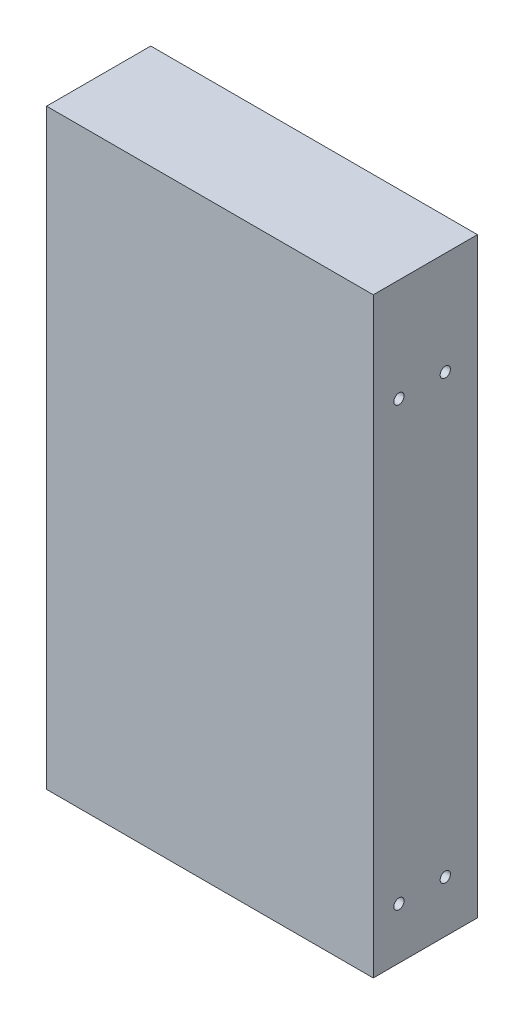
ISO-10303-21;
HEADER;
FILE_DESCRIPTION(('STEP AP214'),'2;1');
FILE_NAME('part.step','',(''),(''),'','','');
FILE_SCHEMA(('AUTOMOTIVE_DESIGN { 1 0 10303 214 1 1 1 1 }'));
ENDSEC;
DATA;
#1=APPLICATION_CONTEXT('core data for automotive mechanical design processes');
#2=APPLICATION_PROTOCOL_DEFINITION('international standard','automotive_design',2000,#1);
#3=PRODUCT_CONTEXT('',#1,'mechanical');
#4=PRODUCT('Part','Part','',(#3));
#5=PRODUCT_RELATED_PRODUCT_CATEGORY('part','',(#4));
#6=PRODUCT_DEFINITION_FORMATION('','',#4);
#7=PRODUCT_DEFINITION_CONTEXT('part definition',#1,'design');
#8=PRODUCT_DEFINITION('design','',#6,#7);
#9=PRODUCT_DEFINITION_SHAPE('','',#8);
#10=(LENGTH_UNIT() NAMED_UNIT(*) SI_UNIT(.MILLI.,.METRE.));
#11=(NAMED_UNIT(*) PLANE_ANGLE_UNIT() SI_UNIT($,.RADIAN.));
#12=(NAMED_UNIT(*) SI_UNIT($,.STERADIAN.) SOLID_ANGLE_UNIT());
#13=UNCERTAINTY_MEASURE_WITH_UNIT(LENGTH_MEASURE(1.E-05),#10,'distance_accuracy_value','');
#14=(GEOMETRIC_REPRESENTATION_CONTEXT(3) GLOBAL_UNCERTAINTY_ASSIGNED_CONTEXT((#13)) GLOBAL_UNIT_ASSIGNED_CONTEXT((#10,
#11,#12)) REPRESENTATION_CONTEXT('',''));
#15=CARTESIAN_POINT('',(0.,0.,0.));
#16=DIRECTION('',(0.,0.,1.));
#17=DIRECTION('',(1.,0.,0.));
#18=AXIS2_PLACEMENT_3D('',#15,#16,#17);
#19=CARTESIAN_POINT('',(0.,0.,40.5));
#20=DIRECTION('',(-1.,0.,0.));
#21=DIRECTION('',(0.,0.,1.));
#22=AXIS2_PLACEMENT_3D('',#19,#20,#21);
#23=PLANE('',#22);
#24=CARTESIAN_POINT('',(0.,20.,12.5));
#25=DIRECTION('',(1.,0.,0.));
#26=DIRECTION('',(0.,0.,-1.));
#27=AXIS2_PLACEMENT_3D('',#24,#25,#26);
#28=CIRCLE('',#27,2.00000000000001);
#29=CARTESIAN_POINT('',(0.,20.,10.5));
#30=VERTEX_POINT('',#29);
#31=EDGE_CURVE('E144',#30,#30,#28,.T.);
#32=ORIENTED_EDGE('',*,*,#31,.F.);
#33=EDGE_LOOP('',(#32));
#34=FACE_BOUND('',#33,.T.);
#35=CARTESIAN_POINT('',(0.,190.,30.5));
#36=DIRECTION('',(1.,0.,0.));
#37=DIRECTION('',(0.,0.,1.));
#38=AXIS2_PLACEMENT_3D('',#35,#36,#37);
#39=CIRCLE('',#38,2.);
#40=CARTESIAN_POINT('',(0.,190.,32.5));
#41=VERTEX_POINT('',#40);
#42=EDGE_CURVE('E135',#41,#41,#39,.T.);
#43=ORIENTED_EDGE('',*,*,#42,.F.);
#44=EDGE_LOOP('',(#43));
#45=FACE_BOUND('',#44,.T.);
#46=CARTESIAN_POINT('',(0.,20.,30.5));
#47=DIRECTION('',(1.,0.,0.));
#48=DIRECTION('',(0.,0.,1.));
#49=AXIS2_PLACEMENT_3D('',#46,#47,#48);
#50=CIRCLE('',#49,2.00000000000001);
#51=CARTESIAN_POINT('',(0.,20.,32.5));
#52=VERTEX_POINT('',#51);
#53=EDGE_CURVE('E151',#52,#52,#50,.T.);
#54=ORIENTED_EDGE('',*,*,#53,.F.);
#55=EDGE_LOOP('',(#54));
#56=FACE_BOUND('',#55,.T.);
#57=CARTESIAN_POINT('',(0.,190.,12.5));
#58=DIRECTION('',(1.,0.,0.));
#59=DIRECTION('',(0.,0.,-1.));
#60=AXIS2_PLACEMENT_3D('',#57,#58,#59);
#61=CIRCLE('',#60,2.);
#62=CARTESIAN_POINT('',(0.,190.,10.5));
#63=VERTEX_POINT('',#62);
#64=EDGE_CURVE('E127',#63,#63,#61,.T.);
#65=ORIENTED_EDGE('',*,*,#64,.F.);
#66=EDGE_LOOP('',(#65));
#67=FACE_BOUND('',#66,.T.);
#68=DIRECTION('',(0.,1.,0.));
#69=VECTOR('',#68,1.);
#70=CARTESIAN_POINT('',(0.,0.,0.));
#71=LINE('',#70,#69);
#72=CARTESIAN_POINT('',(0.,0.,0.));
#73=VERTEX_POINT('',#72);
#74=CARTESIAN_POINT('',(0.,230.,0.));
#75=VERTEX_POINT('',#74);
#76=EDGE_CURVE('E108',#73,#75,#71,.T.);
#77=ORIENTED_EDGE('',*,*,#76,.T.);
#78=DIRECTION('',(0.,0.,-1.));
#79=VECTOR('',#78,1.);
#80=CARTESIAN_POINT('',(0.,230.,40.5));
#81=LINE('',#80,#79);
#82=CARTESIAN_POINT('',(0.,230.,40.5));
#83=VERTEX_POINT('',#82);
#84=EDGE_CURVE('E11',#83,#75,#81,.T.);
#85=ORIENTED_EDGE('',*,*,#84,.F.);
#86=DIRECTION('',(0.,1.,0.));
#87=VECTOR('',#86,1.);
#88=CARTESIAN_POINT('',(0.,0.,40.5));
#89=LINE('',#88,#87);
#90=CARTESIAN_POINT('',(0.,0.,40.5));
#91=VERTEX_POINT('',#90);
#92=EDGE_CURVE('E90',#91,#83,#89,.T.);
#93=ORIENTED_EDGE('',*,*,#92,.F.);
#94=DIRECTION('',(0.,0.,-1.));
#95=VECTOR('',#94,1.);
#96=CARTESIAN_POINT('',(0.,0.,40.5));
#97=LINE('',#96,#95);
#98=EDGE_CURVE('E57',#91,#73,#97,.T.);
#99=ORIENTED_EDGE('',*,*,#98,.T.);
#100=EDGE_LOOP('',(#77,#85,#93,#99));
#101=FACE_BOUND('',#100,.T.);
#102=ADVANCED_FACE('F40',(#34,#45,#56,#67,#101),#23,.F.);
#103=CARTESIAN_POINT('',(0.,230.,40.5));
#104=DIRECTION('',(0.,-1.,0.));
#105=DIRECTION('',(1.,0.,0.));
#106=AXIS2_PLACEMENT_3D('',#103,#104,#105);
#107=PLANE('',#106);
#108=DIRECTION('',(-1.,0.,0.));
#109=VECTOR('',#108,1.);
#110=CARTESIAN_POINT('',(0.,230.,0.));
#111=LINE('',#110,#109);
#112=CARTESIAN_POINT('',(-127.,230.,0.));
#113=VERTEX_POINT('',#112);
#114=EDGE_CURVE('E96',#75,#113,#111,.T.);
#115=ORIENTED_EDGE('',*,*,#114,.T.);
#116=DIRECTION('',(0.,0.,-1.));
#117=VECTOR('',#116,1.);
#118=CARTESIAN_POINT('',(-127.,230.,40.5));
#119=LINE('',#118,#117);
#120=CARTESIAN_POINT('',(-127.,230.,40.5));
#121=VERTEX_POINT('',#120);
#122=EDGE_CURVE('E49',#121,#113,#119,.T.);
#123=ORIENTED_EDGE('',*,*,#122,.F.);
#124=DIRECTION('',(-1.,0.,0.));
#125=VECTOR('',#124,1.);
#126=CARTESIAN_POINT('',(0.,230.,40.5));
#127=LINE('',#126,#125);
#128=EDGE_CURVE('E82',#83,#121,#127,.T.);
#129=ORIENTED_EDGE('',*,*,#128,.F.);
#130=ORIENTED_EDGE('',*,*,#84,.T.);
#131=EDGE_LOOP('',(#115,#123,#129,#130));
#132=FACE_BOUND('',#131,.T.);
#133=ADVANCED_FACE('F95',(#132),#107,.F.);
#134=CARTESIAN_POINT('',(-127.,0.,40.5));
#135=DIRECTION('',(-1.,0.,0.));
#136=DIRECTION('',(0.,0.,1.));
#137=AXIS2_PLACEMENT_3D('',#134,#135,#136);
#138=PLANE('',#137);
#139=DIRECTION('',(0.,1.,0.));
#140=VECTOR('',#139,1.);
#141=CARTESIAN_POINT('',(-127.,0.,0.));
#142=LINE('',#141,#140);
#143=CARTESIAN_POINT('',(-127.,0.,0.));
#144=VERTEX_POINT('',#143);
#145=EDGE_CURVE('E114',#144,#113,#142,.T.);
#146=ORIENTED_EDGE('',*,*,#145,.F.);
#147=DIRECTION('',(0.,0.,-1.));
#148=VECTOR('',#147,1.);
#149=CARTESIAN_POINT('',(-127.,0.,40.5));
#150=LINE('',#149,#148);
#151=CARTESIAN_POINT('',(-127.,0.,40.5));
#152=VERTEX_POINT('',#151);
#153=EDGE_CURVE('E71',#152,#144,#150,.T.);
#154=ORIENTED_EDGE('',*,*,#153,.F.);
#155=DIRECTION('',(0.,1.,0.));
#156=VECTOR('',#155,1.);
#157=CARTESIAN_POINT('',(-127.,0.,40.5));
#158=LINE('',#157,#156);
#159=EDGE_CURVE('E89',#152,#121,#158,.T.);
#160=ORIENTED_EDGE('',*,*,#159,.T.);
#161=ORIENTED_EDGE('',*,*,#122,.T.);
#162=EDGE_LOOP('',(#146,#154,#160,#161));
#163=FACE_BOUND('',#162,.T.);
#164=ADVANCED_FACE('F100',(#163),#138,.T.);
#165=CARTESIAN_POINT('',(0.,0.,40.5));
#166=DIRECTION('',(0.,-1.,0.));
#167=DIRECTION('',(1.,0.,0.));
#168=AXIS2_PLACEMENT_3D('',#165,#166,#167);
#169=PLANE('',#168);
#170=DIRECTION('',(-1.,0.,0.));
#171=VECTOR('',#170,1.);
#172=CARTESIAN_POINT('',(0.,0.,0.));
#173=LINE('',#172,#171);
#174=EDGE_CURVE('E117',#73,#144,#173,.T.);
#175=ORIENTED_EDGE('',*,*,#174,.F.);
#176=ORIENTED_EDGE('',*,*,#98,.F.);
#177=DIRECTION('',(-1.,0.,0.));
#178=VECTOR('',#177,1.);
#179=CARTESIAN_POINT('',(0.,0.,40.5));
#180=LINE('',#179,#178);
#181=EDGE_CURVE('E102',#91,#152,#180,.T.);
#182=ORIENTED_EDGE('',*,*,#181,.T.);
#183=ORIENTED_EDGE('',*,*,#153,.T.);
#184=EDGE_LOOP('',(#175,#176,#182,#183));
#185=FACE_BOUND('',#184,.T.);
#186=ADVANCED_FACE('F173',(#185),#169,.T.);
#187=CARTESIAN_POINT('',(0.,0.,40.5));
#188=DIRECTION('',(0.,0.,1.));
#189=DIRECTION('',(1.,0.,0.));
#190=AXIS2_PLACEMENT_3D('',#187,#188,#189);
#191=PLANE('',#190);
#192=ORIENTED_EDGE('',*,*,#92,.T.);
#193=ORIENTED_EDGE('',*,*,#128,.T.);
#194=ORIENTED_EDGE('',*,*,#159,.F.);
#195=ORIENTED_EDGE('',*,*,#181,.F.);
#196=EDGE_LOOP('',(#192,#193,#194,#195));
#197=FACE_BOUND('',#196,.T.);
#198=ADVANCED_FACE('F86',(#197),#191,.T.);
#199=CARTESIAN_POINT('',(0.,0.,0.));
#200=DIRECTION('',(0.,0.,1.));
#201=DIRECTION('',(1.,0.,0.));
#202=AXIS2_PLACEMENT_3D('',#199,#200,#201);
#203=PLANE('',#202);
#204=ORIENTED_EDGE('',*,*,#76,.F.);
#205=ORIENTED_EDGE('',*,*,#174,.T.);
#206=ORIENTED_EDGE('',*,*,#145,.T.);
#207=ORIENTED_EDGE('',*,*,#114,.F.);
#208=EDGE_LOOP('',(#204,#205,#206,#207));
#209=FACE_BOUND('',#208,.T.);
#210=ADVANCED_FACE('F172',(#209),#203,.F.);
#211=CARTESIAN_POINT('',(-10.,190.,12.5));
#212=DIRECTION('',(1.,0.,0.));
#213=DIRECTION('',(0.,0.,-1.));
#214=AXIS2_PLACEMENT_3D('',#211,#212,#213);
#215=CYLINDRICAL_SURFACE('',#214,2.);
#216=CARTESIAN_POINT('',(-10.,190.,12.5));
#217=DIRECTION('',(1.,0.,0.));
#218=DIRECTION('',(0.,0.,-1.));
#219=AXIS2_PLACEMENT_3D('',#216,#217,#218);
#220=CIRCLE('',#219,2.);
#221=CARTESIAN_POINT('',(-10.,190.,10.5));
#222=VERTEX_POINT('',#221);
#223=EDGE_CURVE('E111',#222,#222,#220,.T.);
#224=ORIENTED_EDGE('',*,*,#223,.F.);
#225=EDGE_LOOP('',(#224));
#226=FACE_BOUND('',#225,.T.);
#227=ORIENTED_EDGE('',*,*,#64,.T.);
#228=EDGE_LOOP('',(#227));
#229=FACE_BOUND('',#228,.T.);
#230=ADVANCED_FACE('F211',(#226,#229),#215,.F.);
#231=CARTESIAN_POINT('',(-10.,190.,12.5));
#232=DIRECTION('',(1.,0.,0.));
#233=DIRECTION('',(0.,0.,-1.));
#234=AXIS2_PLACEMENT_3D('',#231,#232,#233);
#235=PLANE('',#234);
#236=ORIENTED_EDGE('',*,*,#223,.T.);
#237=EDGE_LOOP('',(#236));
#238=FACE_BOUND('',#237,.T.);
#239=ADVANCED_FACE('F164',(#238),#235,.T.);
#240=CARTESIAN_POINT('',(-10.,20.,30.5));
#241=DIRECTION('',(1.,0.,0.));
#242=DIRECTION('',(0.,0.,-1.));
#243=AXIS2_PLACEMENT_3D('',#240,#241,#242);
#244=CYLINDRICAL_SURFACE('',#243,2.00000000000001);
#245=CARTESIAN_POINT('',(-10.,20.,30.5));
#246=DIRECTION('',(1.,0.,0.));
#247=DIRECTION('',(0.,0.,1.));
#248=AXIS2_PLACEMENT_3D('',#245,#246,#247);
#249=CIRCLE('',#248,2.00000000000001);
#250=CARTESIAN_POINT('',(-10.,20.,32.5));
#251=VERTEX_POINT('',#250);
#252=EDGE_CURVE('E140',#251,#251,#249,.T.);
#253=ORIENTED_EDGE('',*,*,#252,.F.);
#254=EDGE_LOOP('',(#253));
#255=FACE_BOUND('',#254,.T.);
#256=ORIENTED_EDGE('',*,*,#53,.T.);
#257=EDGE_LOOP('',(#256));
#258=FACE_BOUND('',#257,.T.);
#259=ADVANCED_FACE('F161',(#255,#258),#244,.F.);
#260=CARTESIAN_POINT('',(-10.,20.,30.5));
#261=DIRECTION('',(-1.,0.,0.));
#262=DIRECTION('',(0.,0.,1.));
#263=AXIS2_PLACEMENT_3D('',#260,#261,#262);
#264=PLANE('',#263);
#265=ORIENTED_EDGE('',*,*,#252,.T.);
#266=EDGE_LOOP('',(#265));
#267=FACE_BOUND('',#266,.T.);
#268=ADVANCED_FACE('F159',(#267),#264,.F.);
#269=CARTESIAN_POINT('',(-10.,190.,30.5));
#270=DIRECTION('',(1.,0.,0.));
#271=DIRECTION('',(0.,0.,-1.));
#272=AXIS2_PLACEMENT_3D('',#269,#270,#271);
#273=CYLINDRICAL_SURFACE('',#272,2.);
#274=CARTESIAN_POINT('',(-10.,190.,30.5));
#275=DIRECTION('',(1.,0.,0.));
#276=DIRECTION('',(0.,0.,1.));
#277=AXIS2_PLACEMENT_3D('',#274,#275,#276);
#278=CIRCLE('',#277,2.);
#279=CARTESIAN_POINT('',(-10.,190.,32.5));
#280=VERTEX_POINT('',#279);
#281=EDGE_CURVE('E139',#280,#280,#278,.T.);
#282=ORIENTED_EDGE('',*,*,#281,.F.);
#283=EDGE_LOOP('',(#282));
#284=FACE_BOUND('',#283,.T.);
#285=ORIENTED_EDGE('',*,*,#42,.T.);
#286=EDGE_LOOP('',(#285));
#287=FACE_BOUND('',#286,.T.);
#288=ADVANCED_FACE('F245',(#284,#287),#273,.F.);
#289=CARTESIAN_POINT('',(-10.,190.,30.5));
#290=DIRECTION('',(-1.,0.,0.));
#291=DIRECTION('',(0.,0.,1.));
#292=AXIS2_PLACEMENT_3D('',#289,#290,#291);
#293=PLANE('',#292);
#294=ORIENTED_EDGE('',*,*,#281,.T.);
#295=EDGE_LOOP('',(#294));
#296=FACE_BOUND('',#295,.T.);
#297=ADVANCED_FACE('F254',(#296),#293,.F.);
#298=CARTESIAN_POINT('',(-10.,20.,12.5));
#299=DIRECTION('',(1.,0.,0.));
#300=DIRECTION('',(0.,0.,-1.));
#301=AXIS2_PLACEMENT_3D('',#298,#299,#300);
#302=CYLINDRICAL_SURFACE('',#301,2.00000000000001);
#303=CARTESIAN_POINT('',(-10.,20.,12.5));
#304=DIRECTION('',(1.,0.,0.));
#305=DIRECTION('',(0.,0.,-1.));
#306=AXIS2_PLACEMENT_3D('',#303,#304,#305);
#307=CIRCLE('',#306,2.00000000000001);
#308=CARTESIAN_POINT('',(-10.,20.,10.5));
#309=VERTEX_POINT('',#308);
#310=EDGE_CURVE('E131',#309,#309,#307,.T.);
#311=ORIENTED_EDGE('',*,*,#310,.F.);
#312=EDGE_LOOP('',(#311));
#313=FACE_BOUND('',#312,.T.);
#314=ORIENTED_EDGE('',*,*,#31,.T.);
#315=EDGE_LOOP('',(#314));
#316=FACE_BOUND('',#315,.T.);
#317=ADVANCED_FACE('F264',(#313,#316),#302,.F.);
#318=CARTESIAN_POINT('',(-10.,20.,12.5));
#319=DIRECTION('',(1.,0.,0.));
#320=DIRECTION('',(0.,0.,-1.));
#321=AXIS2_PLACEMENT_3D('',#318,#319,#320);
#322=PLANE('',#321);
#323=ORIENTED_EDGE('',*,*,#310,.T.);
#324=EDGE_LOOP('',(#323));
#325=FACE_BOUND('',#324,.T.);
#326=ADVANCED_FACE('F274',(#325),#322,.T.);
#327=CLOSED_SHELL('',(#102,#133,#164,#186,#198,#210,#230,#239,#259,#268,#288,#297,#317,#326));
#328=MANIFOLD_SOLID_BREP('B2',#327);
#329=ADVANCED_BREP_SHAPE_REPRESENTATION('',(#18,#328),#14);
#330=SHAPE_DEFINITION_REPRESENTATION(#9,#329);
ENDSEC;
END-ISO-10303-21;
